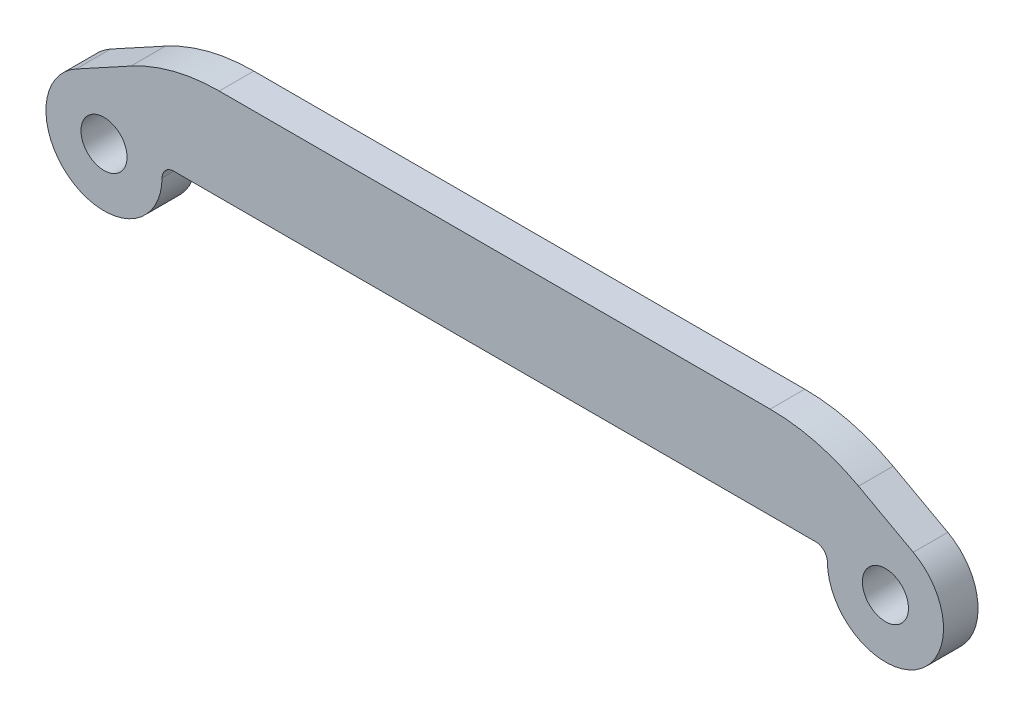
ISO-10303-21;
HEADER;
FILE_DESCRIPTION(('STEP AP214'),'2;1');
FILE_NAME('part.step','',(''),(''),'','','');
FILE_SCHEMA(('AUTOMOTIVE_DESIGN { 1 0 10303 214 1 1 1 1 }'));
ENDSEC;
DATA;
#1=APPLICATION_CONTEXT('core data for automotive mechanical design processes');
#2=APPLICATION_PROTOCOL_DEFINITION('international standard','automotive_design',2000,#1);
#3=PRODUCT_CONTEXT('',#1,'mechanical');
#4=PRODUCT('Part','Part','',(#3));
#5=PRODUCT_RELATED_PRODUCT_CATEGORY('part','',(#4));
#6=PRODUCT_DEFINITION_FORMATION('','',#4);
#7=PRODUCT_DEFINITION_CONTEXT('part definition',#1,'design');
#8=PRODUCT_DEFINITION('design','',#6,#7);
#9=PRODUCT_DEFINITION_SHAPE('','',#8);
#10=(LENGTH_UNIT() NAMED_UNIT(*) SI_UNIT(.MILLI.,.METRE.));
#11=(NAMED_UNIT(*) PLANE_ANGLE_UNIT() SI_UNIT($,.RADIAN.));
#12=(NAMED_UNIT(*) SI_UNIT($,.STERADIAN.) SOLID_ANGLE_UNIT());
#13=UNCERTAINTY_MEASURE_WITH_UNIT(LENGTH_MEASURE(1.E-05),#10,'distance_accuracy_value','');
#14=(GEOMETRIC_REPRESENTATION_CONTEXT(3) GLOBAL_UNCERTAINTY_ASSIGNED_CONTEXT((#13)) GLOBAL_UNIT_ASSIGNED_CONTEXT((#10,
#11,#12)) REPRESENTATION_CONTEXT('',''));
#15=CARTESIAN_POINT('',(0.,0.,0.));
#16=DIRECTION('',(0.,0.,1.));
#17=DIRECTION('',(1.,0.,0.));
#18=AXIS2_PLACEMENT_3D('',#15,#16,#17);
#19=CARTESIAN_POINT('',(-26.924,-7.1247,1.190625));
#20=DIRECTION('',(0.,0.,1.));
#21=DIRECTION('',(1.,0.,0.));
#22=AXIS2_PLACEMENT_3D('',#19,#20,#21);
#23=PLANE('',#22);
#24=CARTESIAN_POINT('',(-26.924,-7.1247,1.190625));
#25=DIRECTION('',(0.,0.,1.));
#26=DIRECTION('',(1.,0.,0.));
#27=AXIS2_PLACEMENT_3D('',#24,#25,#26);
#28=CIRCLE('',#27,1.5875);
#29=CARTESIAN_POINT('',(-25.3365,-7.1247,1.190625));
#30=VERTEX_POINT('',#29);
#31=EDGE_CURVE('E194',#30,#30,#28,.T.);
#32=ORIENTED_EDGE('',*,*,#31,.F.);
#33=EDGE_LOOP('',(#32));
#34=FACE_BOUND('',#33,.T.);
#35=DIRECTION('',(-0.877633945750313,0.479331469097051,0.));
#36=VECTOR('',#35,1.);
#37=CARTESIAN_POINT('',(22.225,0.,1.190625));
#38=LINE('',#37,#36);
#39=CARTESIAN_POINT('',(28.8415655421229,-3.61372540002571,1.190625));
#40=VERTEX_POINT('',#39);
#41=CARTESIAN_POINT('',(25.0703922728791,-1.55404888897103,1.190625));
#42=VERTEX_POINT('',#41);
#43=EDGE_CURVE('E189',#40,#42,#38,.T.);
#44=ORIENTED_EDGE('',*,*,#43,.T.);
#45=CARTESIAN_POINT('',(18.9828826153465,-12.7,1.190625));
#46=DIRECTION('',(0.,0.,1.));
#47=DIRECTION('',(1.,0.,0.));
#48=AXIS2_PLACEMENT_3D('',#45,#46,#47);
#49=CIRCLE('',#48,12.7);
#50=CARTESIAN_POINT('',(18.9828826153465,0.,1.190625));
#51=VERTEX_POINT('',#50);
#52=EDGE_CURVE('E162',#42,#51,#49,.T.);
#53=ORIENTED_EDGE('',*,*,#52,.T.);
#54=DIRECTION('',(-1.,0.,0.));
#55=VECTOR('',#54,1.);
#56=CARTESIAN_POINT('',(-22.225,0.,1.190625));
#57=LINE('',#56,#55);
#58=CARTESIAN_POINT('',(-18.9828826153463,0.,1.190625));
#59=VERTEX_POINT('',#58);
#60=EDGE_CURVE('E142',#51,#59,#57,.T.);
#61=ORIENTED_EDGE('',*,*,#60,.T.);
#62=CARTESIAN_POINT('',(-18.9828826153463,-12.7,1.190625));
#63=DIRECTION('',(0.,0.,1.));
#64=DIRECTION('',(1.,0.,0.));
#65=AXIS2_PLACEMENT_3D('',#62,#63,#64);
#66=CIRCLE('',#65,12.7);
#67=CARTESIAN_POINT('',(-25.0703922728792,-1.55404888897119,1.190625));
#68=VERTEX_POINT('',#67);
#69=EDGE_CURVE('E49',#59,#68,#66,.T.);
#70=ORIENTED_EDGE('',*,*,#69,.T.);
#71=DIRECTION('',(-0.877633945750299,-0.479331469097075,0.));
#72=VECTOR('',#71,1.);
#73=CARTESIAN_POINT('',(-22.225,0.,1.190625));
#74=LINE('',#73,#72);
#75=CARTESIAN_POINT('',(-28.8415655421229,-3.61372540002593,1.190625));
#76=VERTEX_POINT('',#75);
#77=EDGE_CURVE('E111',#68,#76,#74,.T.);
#78=ORIENTED_EDGE('',*,*,#77,.T.);
#79=CARTESIAN_POINT('',(-26.924,-7.1247,1.190625));
#80=DIRECTION('',(0.,0.,1.));
#81=DIRECTION('',(1.,0.,0.));
#82=AXIS2_PLACEMENT_3D('',#79,#80,#81);
#83=CIRCLE('',#82,4.0005);
#84=CARTESIAN_POINT('',(-22.9236253300381,-7.15636622691293,1.190625));
#85=VERTEX_POINT('',#84);
#86=EDGE_CURVE('E114',#76,#85,#83,.T.);
#87=ORIENTED_EDGE('',*,*,#86,.T.);
#88=CARTESIAN_POINT('',(-22.1108507939188,-7.1628,1.190625));
#89=DIRECTION('',(0.,0.,1.));
#90=DIRECTION('',(1.,0.,0.));
#91=AXIS2_PLACEMENT_3D('',#88,#89,#90);
#92=CIRCLE('',#91,0.8128);
#93=CARTESIAN_POINT('',(-22.1108507939188,-6.35,1.190625));
#94=VERTEX_POINT('',#93);
#95=EDGE_CURVE('E12',#85,#94,#92,.F.);
#96=ORIENTED_EDGE('',*,*,#95,.T.);
#97=DIRECTION('',(1.,0.,0.));
#98=VECTOR('',#97,1.);
#99=CARTESIAN_POINT('',(-22.9235,-6.35,1.190625));
#100=LINE('',#99,#98);
#101=CARTESIAN_POINT('',(22.1108507939188,-6.34999999999978,1.190625));
#102=VERTEX_POINT('',#101);
#103=EDGE_CURVE('E129',#94,#102,#100,.T.);
#104=ORIENTED_EDGE('',*,*,#103,.T.);
#105=CARTESIAN_POINT('',(22.1108507939189,-7.16279999999978,1.190625));
#106=DIRECTION('',(0.,0.,1.));
#107=DIRECTION('',(1.,0.,0.));
#108=AXIS2_PLACEMENT_3D('',#105,#106,#107);
#109=CIRCLE('',#108,0.8128);
#110=CARTESIAN_POINT('',(22.9236253300381,-7.15636622691271,1.190625));
#111=VERTEX_POINT('',#110);
#112=EDGE_CURVE('E168',#102,#111,#109,.F.);
#113=ORIENTED_EDGE('',*,*,#112,.T.);
#114=CARTESIAN_POINT('',(26.924,-7.12469999999978,1.190625));
#115=DIRECTION('',(0.,0.,1.));
#116=DIRECTION('',(-1.,0.,0.));
#117=AXIS2_PLACEMENT_3D('',#114,#115,#116);
#118=CIRCLE('',#117,4.00049999999999);
#119=EDGE_CURVE('E187',#111,#40,#118,.T.);
#120=ORIENTED_EDGE('',*,*,#119,.T.);
#121=EDGE_LOOP('',(#44,#53,#61,#70,#78,#87,#96,#104,#113,#120));
#122=FACE_BOUND('',#121,.T.);
#123=CARTESIAN_POINT('',(26.924,-7.12469999999978,1.190625));
#124=DIRECTION('',(0.,0.,1.));
#125=DIRECTION('',(-1.,0.,0.));
#126=AXIS2_PLACEMENT_3D('',#123,#124,#125);
#127=CIRCLE('',#126,1.58750000000001);
#128=CARTESIAN_POINT('',(25.3365,-7.12469999999978,1.190625));
#129=VERTEX_POINT('',#128);
#130=EDGE_CURVE('E335',#129,#129,#127,.T.);
#131=ORIENTED_EDGE('',*,*,#130,.F.);
#132=EDGE_LOOP('',(#131));
#133=FACE_BOUND('',#132,.T.);
#134=ADVANCED_FACE('F34',(#34,#122,#133),#23,.T.);
#135=CARTESIAN_POINT('',(-26.924,-7.1247,-1.190625));
#136=DIRECTION('',(0.,0.,1.));
#137=DIRECTION('',(1.,0.,0.));
#138=AXIS2_PLACEMENT_3D('',#135,#136,#137);
#139=PLANE('',#138);
#140=DIRECTION('',(-1.,0.,0.));
#141=VECTOR('',#140,1.);
#142=CARTESIAN_POINT('',(-22.225,0.,-1.190625));
#143=LINE('',#142,#141);
#144=CARTESIAN_POINT('',(18.9828826153465,0.,-1.190625));
#145=VERTEX_POINT('',#144);
#146=CARTESIAN_POINT('',(-18.9828826153463,0.,-1.190625));
#147=VERTEX_POINT('',#146);
#148=EDGE_CURVE('E120',#145,#147,#143,.T.);
#149=ORIENTED_EDGE('',*,*,#148,.F.);
#150=CARTESIAN_POINT('',(18.9828826153465,-12.7,-1.190625));
#151=DIRECTION('',(0.,0.,1.));
#152=DIRECTION('',(1.,0.,0.));
#153=AXIS2_PLACEMENT_3D('',#150,#151,#152);
#154=CIRCLE('',#153,12.7);
#155=CARTESIAN_POINT('',(25.0703922728791,-1.55404888897103,-1.190625));
#156=VERTEX_POINT('',#155);
#157=EDGE_CURVE('E158',#145,#156,#154,.F.);
#158=ORIENTED_EDGE('',*,*,#157,.T.);
#159=DIRECTION('',(-0.877633945750313,0.479331469097051,0.));
#160=VECTOR('',#159,1.);
#161=CARTESIAN_POINT('',(22.225,0.,-1.190625));
#162=LINE('',#161,#160);
#163=CARTESIAN_POINT('',(28.8415655421229,-3.61372540002571,-1.190625));
#164=VERTEX_POINT('',#163);
#165=EDGE_CURVE('E199',#164,#156,#162,.T.);
#166=ORIENTED_EDGE('',*,*,#165,.F.);
#167=CARTESIAN_POINT('',(26.924,-7.12469999999978,-1.190625));
#168=DIRECTION('',(0.,0.,1.));
#169=DIRECTION('',(-1.,0.,0.));
#170=AXIS2_PLACEMENT_3D('',#167,#168,#169);
#171=CIRCLE('',#170,4.00049999999999);
#172=CARTESIAN_POINT('',(22.9236253300381,-7.15636622691271,-1.190625));
#173=VERTEX_POINT('',#172);
#174=EDGE_CURVE('E197',#173,#164,#171,.T.);
#175=ORIENTED_EDGE('',*,*,#174,.F.);
#176=CARTESIAN_POINT('',(22.1108507939189,-7.16279999999978,-1.190625));
#177=DIRECTION('',(0.,0.,1.));
#178=DIRECTION('',(1.,0.,0.));
#179=AXIS2_PLACEMENT_3D('',#176,#177,#178);
#180=CIRCLE('',#179,0.8128);
#181=CARTESIAN_POINT('',(22.1108507939188,-6.34999999999978,-1.190625));
#182=VERTEX_POINT('',#181);
#183=EDGE_CURVE('E166',#173,#182,#180,.T.);
#184=ORIENTED_EDGE('',*,*,#183,.T.);
#185=DIRECTION('',(1.,0.,0.));
#186=VECTOR('',#185,1.);
#187=CARTESIAN_POINT('',(-22.9235,-6.35,-1.190625));
#188=LINE('',#187,#186);
#189=CARTESIAN_POINT('',(-22.1108507939188,-6.35,-1.190625));
#190=VERTEX_POINT('',#189);
#191=EDGE_CURVE('E176',#190,#182,#188,.T.);
#192=ORIENTED_EDGE('',*,*,#191,.F.);
#193=CARTESIAN_POINT('',(-22.1108507939188,-7.1628,-1.190625));
#194=DIRECTION('',(0.,0.,1.));
#195=DIRECTION('',(1.,0.,0.));
#196=AXIS2_PLACEMENT_3D('',#193,#194,#195);
#197=CIRCLE('',#196,0.8128);
#198=CARTESIAN_POINT('',(-22.9236253300381,-7.15636622691293,-1.190625));
#199=VERTEX_POINT('',#198);
#200=EDGE_CURVE('E42',#190,#199,#197,.T.);
#201=ORIENTED_EDGE('',*,*,#200,.T.);
#202=CARTESIAN_POINT('',(-26.924,-7.1247,-1.190625));
#203=DIRECTION('',(0.,0.,1.));
#204=DIRECTION('',(1.,0.,0.));
#205=AXIS2_PLACEMENT_3D('',#202,#203,#204);
#206=CIRCLE('',#205,4.0005);
#207=CARTESIAN_POINT('',(-28.8415655421229,-3.61372540002593,-1.190625));
#208=VERTEX_POINT('',#207);
#209=EDGE_CURVE('E174',#208,#199,#206,.T.);
#210=ORIENTED_EDGE('',*,*,#209,.F.);
#211=DIRECTION('',(-0.877633945750299,-0.479331469097075,0.));
#212=VECTOR('',#211,1.);
#213=CARTESIAN_POINT('',(-22.225,0.,-1.190625));
#214=LINE('',#213,#212);
#215=CARTESIAN_POINT('',(-25.0703922728792,-1.55404888897119,-1.190625));
#216=VERTEX_POINT('',#215);
#217=EDGE_CURVE('E133',#216,#208,#214,.T.);
#218=ORIENTED_EDGE('',*,*,#217,.F.);
#219=CARTESIAN_POINT('',(-18.9828826153463,-12.7,-1.190625));
#220=DIRECTION('',(0.,0.,1.));
#221=DIRECTION('',(1.,0.,0.));
#222=AXIS2_PLACEMENT_3D('',#219,#220,#221);
#223=CIRCLE('',#222,12.7);
#224=EDGE_CURVE('E156',#216,#147,#223,.F.);
#225=ORIENTED_EDGE('',*,*,#224,.T.);
#226=EDGE_LOOP('',(#149,#158,#166,#175,#184,#192,#201,#210,#218,#225));
#227=FACE_BOUND('',#226,.T.);
#228=CARTESIAN_POINT('',(-26.924,-7.1247,-1.190625));
#229=DIRECTION('',(0.,0.,1.));
#230=DIRECTION('',(1.,0.,0.));
#231=AXIS2_PLACEMENT_3D('',#228,#229,#230);
#232=CIRCLE('',#231,1.5875);
#233=CARTESIAN_POINT('',(-25.3365,-7.1247,-1.190625));
#234=VERTEX_POINT('',#233);
#235=EDGE_CURVE('E334',#234,#234,#232,.T.);
#236=ORIENTED_EDGE('',*,*,#235,.T.);
#237=EDGE_LOOP('',(#236));
#238=FACE_BOUND('',#237,.T.);
#239=CARTESIAN_POINT('',(26.924,-7.12469999999978,-1.190625));
#240=DIRECTION('',(0.,0.,1.));
#241=DIRECTION('',(-1.,0.,0.));
#242=AXIS2_PLACEMENT_3D('',#239,#240,#241);
#243=CIRCLE('',#242,1.58750000000001);
#244=CARTESIAN_POINT('',(25.3365,-7.12469999999978,-1.190625));
#245=VERTEX_POINT('',#244);
#246=EDGE_CURVE('E339',#245,#245,#243,.T.);
#247=ORIENTED_EDGE('',*,*,#246,.T.);
#248=EDGE_LOOP('',(#247));
#249=FACE_BOUND('',#248,.T.);
#250=ADVANCED_FACE('F172',(#227,#238,#249),#139,.F.);
#251=CARTESIAN_POINT('',(-22.225,0.,1.190625));
#252=DIRECTION('',(0.479331469097075,-0.8776339457503,0.));
#253=DIRECTION('',(0.877633945750299,0.479331469097075,0.));
#254=AXIS2_PLACEMENT_3D('',#251,#252,#253);
#255=PLANE('',#254);
#256=ORIENTED_EDGE('',*,*,#77,.F.);
#257=DIRECTION('',(0.,0.,-1.));
#258=VECTOR('',#257,1.);
#259=CARTESIAN_POINT('',(-25.0703922728792,-1.55404888897119,1.190625));
#260=LINE('',#259,#258);
#261=EDGE_CURVE('E164',#68,#216,#260,.T.);
#262=ORIENTED_EDGE('',*,*,#261,.T.);
#263=ORIENTED_EDGE('',*,*,#217,.T.);
#264=DIRECTION('',(0.,0.,-1.));
#265=VECTOR('',#264,1.);
#266=CARTESIAN_POINT('',(-28.8415655421229,-3.61372540002593,1.190625));
#267=LINE('',#266,#265);
#268=EDGE_CURVE('E126',#76,#208,#267,.T.);
#269=ORIENTED_EDGE('',*,*,#268,.F.);
#270=EDGE_LOOP('',(#256,#262,#263,#269));
#271=FACE_BOUND('',#270,.T.);
#272=ADVANCED_FACE('F131',(#271),#255,.F.);
#273=CARTESIAN_POINT('',(-26.924,-7.1247,1.190625));
#274=DIRECTION('',(0.,0.,-1.));
#275=DIRECTION('',(-1.,0.,0.));
#276=AXIS2_PLACEMENT_3D('',#273,#274,#275);
#277=CYLINDRICAL_SURFACE('',#276,4.0005);
#278=ORIENTED_EDGE('',*,*,#209,.T.);
#279=DIRECTION('',(0.,0.,-1.));
#280=VECTOR('',#279,1.);
#281=CARTESIAN_POINT('',(-22.9236253300381,-7.15636622691293,1.190625));
#282=LINE('',#281,#280);
#283=EDGE_CURVE('E128',#199,#85,#282,.F.);
#284=ORIENTED_EDGE('',*,*,#283,.T.);
#285=ORIENTED_EDGE('',*,*,#86,.F.);
#286=ORIENTED_EDGE('',*,*,#268,.T.);
#287=EDGE_LOOP('',(#278,#284,#285,#286));
#288=FACE_BOUND('',#287,.T.);
#289=ADVANCED_FACE('F125',(#288),#277,.T.);
#290=CARTESIAN_POINT('',(-22.9235,-6.35,1.190625));
#291=DIRECTION('',(0.,1.,0.));
#292=DIRECTION('',(-1.,0.,0.));
#293=AXIS2_PLACEMENT_3D('',#290,#291,#292);
#294=PLANE('',#293);
#295=ORIENTED_EDGE('',*,*,#191,.T.);
#296=DIRECTION('',(0.,0.,1.));
#297=VECTOR('',#296,1.);
#298=CARTESIAN_POINT('',(22.1108507939189,-6.34999999999978,1.190625));
#299=LINE('',#298,#297);
#300=EDGE_CURVE('E148',#182,#102,#299,.T.);
#301=ORIENTED_EDGE('',*,*,#300,.T.);
#302=ORIENTED_EDGE('',*,*,#103,.F.);
#303=DIRECTION('',(0.,0.,1.));
#304=VECTOR('',#303,1.);
#305=CARTESIAN_POINT('',(-22.1108507939188,-6.35,-1.190625));
#306=LINE('',#305,#304);
#307=EDGE_CURVE('E139',#94,#190,#306,.F.);
#308=ORIENTED_EDGE('',*,*,#307,.T.);
#309=EDGE_LOOP('',(#295,#301,#302,#308));
#310=FACE_BOUND('',#309,.T.);
#311=ADVANCED_FACE('F185',(#310),#294,.F.);
#312=CARTESIAN_POINT('',(26.924,-7.12469999999978,1.190625));
#313=DIRECTION('',(0.,0.,-1.));
#314=DIRECTION('',(-1.,0.,0.));
#315=AXIS2_PLACEMENT_3D('',#312,#313,#314);
#316=CYLINDRICAL_SURFACE('',#315,4.00049999999999);
#317=ORIENTED_EDGE('',*,*,#119,.F.);
#318=DIRECTION('',(0.,0.,-1.));
#319=VECTOR('',#318,1.);
#320=CARTESIAN_POINT('',(22.9236253300381,-7.15636622691271,1.190625));
#321=LINE('',#320,#319);
#322=EDGE_CURVE('E135',#111,#173,#321,.T.);
#323=ORIENTED_EDGE('',*,*,#322,.T.);
#324=ORIENTED_EDGE('',*,*,#174,.T.);
#325=DIRECTION('',(0.,0.,-1.));
#326=VECTOR('',#325,1.);
#327=CARTESIAN_POINT('',(28.8415655421229,-3.61372540002571,1.190625));
#328=LINE('',#327,#326);
#329=EDGE_CURVE('E136',#40,#164,#328,.T.);
#330=ORIENTED_EDGE('',*,*,#329,.F.);
#331=EDGE_LOOP('',(#317,#323,#324,#330));
#332=FACE_BOUND('',#331,.T.);
#333=ADVANCED_FACE('F230',(#332),#316,.T.);
#334=CARTESIAN_POINT('',(22.225,0.,1.190625));
#335=DIRECTION('',(-0.479331469097051,-0.877633945750313,0.));
#336=DIRECTION('',(0.877633945750313,-0.479331469097051,0.));
#337=AXIS2_PLACEMENT_3D('',#334,#335,#336);
#338=PLANE('',#337);
#339=ORIENTED_EDGE('',*,*,#165,.T.);
#340=DIRECTION('',(0.,0.,-1.));
#341=VECTOR('',#340,1.);
#342=CARTESIAN_POINT('',(25.0703922728791,-1.55404888897103,1.190625));
#343=LINE('',#342,#341);
#344=EDGE_CURVE('E57',#156,#42,#343,.F.);
#345=ORIENTED_EDGE('',*,*,#344,.T.);
#346=ORIENTED_EDGE('',*,*,#43,.F.);
#347=ORIENTED_EDGE('',*,*,#329,.T.);
#348=EDGE_LOOP('',(#339,#345,#346,#347));
#349=FACE_BOUND('',#348,.T.);
#350=ADVANCED_FACE('F227',(#349),#338,.F.);
#351=CARTESIAN_POINT('',(-22.225,0.,1.190625));
#352=DIRECTION('',(0.,-1.,0.));
#353=DIRECTION('',(0.,0.,-1.));
#354=AXIS2_PLACEMENT_3D('',#351,#352,#353);
#355=PLANE('',#354);
#356=ORIENTED_EDGE('',*,*,#60,.F.);
#357=DIRECTION('',(0.,0.,-1.));
#358=VECTOR('',#357,1.);
#359=CARTESIAN_POINT('',(18.9828826153465,0.,1.190625));
#360=LINE('',#359,#358);
#361=EDGE_CURVE('E153',#51,#145,#360,.T.);
#362=ORIENTED_EDGE('',*,*,#361,.T.);
#363=ORIENTED_EDGE('',*,*,#148,.T.);
#364=DIRECTION('',(0.,0.,-1.));
#365=VECTOR('',#364,1.);
#366=CARTESIAN_POINT('',(-18.9828826153463,0.,1.190625));
#367=LINE('',#366,#365);
#368=EDGE_CURVE('E151',#147,#59,#367,.F.);
#369=ORIENTED_EDGE('',*,*,#368,.T.);
#370=EDGE_LOOP('',(#356,#362,#363,#369));
#371=FACE_BOUND('',#370,.T.);
#372=ADVANCED_FACE('F204',(#371),#355,.F.);
#373=CARTESIAN_POINT('',(-26.924,-7.1247,1.190625));
#374=DIRECTION('',(0.,0.,-1.));
#375=DIRECTION('',(-1.,0.,0.));
#376=AXIS2_PLACEMENT_3D('',#373,#374,#375);
#377=CYLINDRICAL_SURFACE('',#376,1.5875);
#378=ORIENTED_EDGE('',*,*,#31,.T.);
#379=EDGE_LOOP('',(#378));
#380=FACE_BOUND('',#379,.T.);
#381=ORIENTED_EDGE('',*,*,#235,.F.);
#382=EDGE_LOOP('',(#381));
#383=FACE_BOUND('',#382,.T.);
#384=ADVANCED_FACE('F222',(#380,#383),#377,.F.);
#385=CARTESIAN_POINT('',(26.924,-7.12469999999978,1.190625));
#386=DIRECTION('',(0.,0.,-1.));
#387=DIRECTION('',(-1.,0.,0.));
#388=AXIS2_PLACEMENT_3D('',#385,#386,#387);
#389=CYLINDRICAL_SURFACE('',#388,1.58750000000001);
#390=ORIENTED_EDGE('',*,*,#130,.T.);
#391=EDGE_LOOP('',(#390));
#392=FACE_BOUND('',#391,.T.);
#393=ORIENTED_EDGE('',*,*,#246,.F.);
#394=EDGE_LOOP('',(#393));
#395=FACE_BOUND('',#394,.T.);
#396=ADVANCED_FACE('F243',(#392,#395),#389,.F.);
#397=CARTESIAN_POINT('',(22.1108507939189,-7.16279999999978,1.190625));
#398=DIRECTION('',(0.,0.,-1.));
#399=DIRECTION('',(-1.,0.,0.));
#400=AXIS2_PLACEMENT_3D('',#397,#398,#399);
#401=CYLINDRICAL_SURFACE('',#400,0.8128);
#402=ORIENTED_EDGE('',*,*,#112,.F.);
#403=ORIENTED_EDGE('',*,*,#300,.F.);
#404=ORIENTED_EDGE('',*,*,#183,.F.);
#405=ORIENTED_EDGE('',*,*,#322,.F.);
#406=EDGE_LOOP('',(#402,#403,#404,#405));
#407=FACE_BOUND('',#406,.T.);
#408=ADVANCED_FACE('F240',(#407),#401,.F.);
#409=CARTESIAN_POINT('',(-22.1108507939188,-7.1628,1.190625));
#410=DIRECTION('',(0.,0.,-1.));
#411=DIRECTION('',(-1.,0.,0.));
#412=AXIS2_PLACEMENT_3D('',#409,#410,#411);
#413=CYLINDRICAL_SURFACE('',#412,0.8128);
#414=ORIENTED_EDGE('',*,*,#95,.F.);
#415=ORIENTED_EDGE('',*,*,#283,.F.);
#416=ORIENTED_EDGE('',*,*,#200,.F.);
#417=ORIENTED_EDGE('',*,*,#307,.F.);
#418=EDGE_LOOP('',(#414,#415,#416,#417));
#419=FACE_BOUND('',#418,.T.);
#420=ADVANCED_FACE('F180',(#419),#413,.F.);
#421=CARTESIAN_POINT('',(18.9828826153465,-12.7,1.190625));
#422=DIRECTION('',(0.,0.,-1.));
#423=DIRECTION('',(-1.,0.,0.));
#424=AXIS2_PLACEMENT_3D('',#421,#422,#423);
#425=CYLINDRICAL_SURFACE('',#424,12.7);
#426=ORIENTED_EDGE('',*,*,#52,.F.);
#427=ORIENTED_EDGE('',*,*,#344,.F.);
#428=ORIENTED_EDGE('',*,*,#157,.F.);
#429=ORIENTED_EDGE('',*,*,#361,.F.);
#430=EDGE_LOOP('',(#426,#427,#428,#429));
#431=FACE_BOUND('',#430,.T.);
#432=ADVANCED_FACE('F208',(#431),#425,.T.);
#433=CARTESIAN_POINT('',(-18.9828826153463,-12.7,1.190625));
#434=DIRECTION('',(0.,0.,-1.));
#435=DIRECTION('',(-1.,0.,0.));
#436=AXIS2_PLACEMENT_3D('',#433,#434,#435);
#437=CYLINDRICAL_SURFACE('',#436,12.7);
#438=ORIENTED_EDGE('',*,*,#69,.F.);
#439=ORIENTED_EDGE('',*,*,#368,.F.);
#440=ORIENTED_EDGE('',*,*,#224,.F.);
#441=ORIENTED_EDGE('',*,*,#261,.F.);
#442=EDGE_LOOP('',(#438,#439,#440,#441));
#443=FACE_BOUND('',#442,.T.);
#444=ADVANCED_FACE('F36',(#443),#437,.T.);
#445=CLOSED_SHELL('',(#134,#250,#272,#289,#311,#333,#350,#372,#384,#396,#408,#420,#432,#444));
#446=MANIFOLD_SOLID_BREP('B2',#445);
#447=ADVANCED_BREP_SHAPE_REPRESENTATION('',(#18,#446),#14);
#448=SHAPE_DEFINITION_REPRESENTATION(#9,#447);
ENDSEC;
END-ISO-10303-21;
